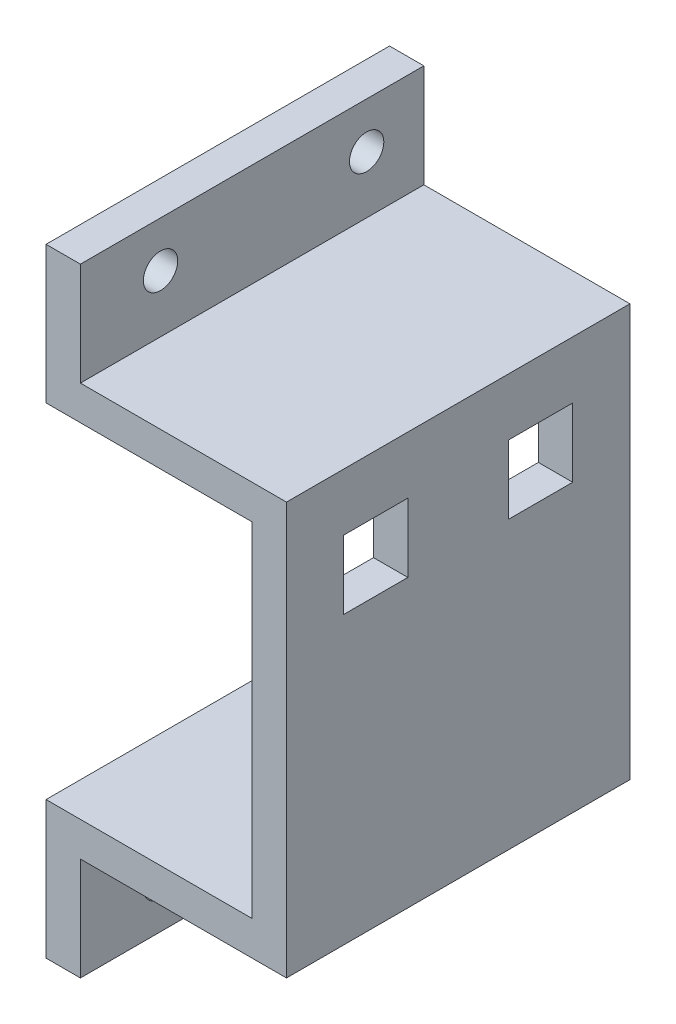
ISO-10303-21;
HEADER;
FILE_DESCRIPTION(('STEP AP214'),'2;1');
FILE_NAME('part.step','',(''),(''),'','','');
FILE_SCHEMA(('AUTOMOTIVE_DESIGN { 1 0 10303 214 1 1 1 1 }'));
ENDSEC;
DATA;
#1=APPLICATION_CONTEXT('core data for automotive mechanical design processes');
#2=APPLICATION_PROTOCOL_DEFINITION('international standard','automotive_design',2000,#1);
#3=PRODUCT_CONTEXT('',#1,'mechanical');
#4=PRODUCT('Part','Part','',(#3));
#5=PRODUCT_RELATED_PRODUCT_CATEGORY('part','',(#4));
#6=PRODUCT_DEFINITION_FORMATION('','',#4);
#7=PRODUCT_DEFINITION_CONTEXT('part definition',#1,'design');
#8=PRODUCT_DEFINITION('design','',#6,#7);
#9=PRODUCT_DEFINITION_SHAPE('','',#8);
#10=(LENGTH_UNIT() NAMED_UNIT(*) SI_UNIT(.MILLI.,.METRE.));
#11=(NAMED_UNIT(*) PLANE_ANGLE_UNIT() SI_UNIT($,.RADIAN.));
#12=(NAMED_UNIT(*) SI_UNIT($,.STERADIAN.) SOLID_ANGLE_UNIT());
#13=UNCERTAINTY_MEASURE_WITH_UNIT(LENGTH_MEASURE(1.E-05),#10,'distance_accuracy_value','');
#14=(GEOMETRIC_REPRESENTATION_CONTEXT(3) GLOBAL_UNCERTAINTY_ASSIGNED_CONTEXT((#13)) GLOBAL_UNIT_ASSIGNED_CONTEXT((#10,
#11,#12)) REPRESENTATION_CONTEXT('',''));
#15=CARTESIAN_POINT('',(0.,0.,0.));
#16=DIRECTION('',(0.,0.,1.));
#17=DIRECTION('',(1.,0.,0.));
#18=AXIS2_PLACEMENT_3D('',#15,#16,#17);
#19=CARTESIAN_POINT('',(18.,0.,15.));
#20=DIRECTION('',(1.,0.,0.));
#21=DIRECTION('',(0.,1.,0.));
#22=AXIS2_PLACEMENT_3D('',#19,#20,#21);
#23=PLANE('',#22);
#24=DIRECTION('',(0.,-1.,0.));
#25=VECTOR('',#24,1.);
#26=CARTESIAN_POINT('',(18.,0.,-15.));
#27=LINE('',#26,#25);
#28=CARTESIAN_POINT('',(18.,0.,-15.));
#29=VERTEX_POINT('',#28);
#30=CARTESIAN_POINT('',(18.,-30.,-15.));
#31=VERTEX_POINT('',#30);
#32=EDGE_CURVE('E268',#29,#31,#27,.T.);
#33=ORIENTED_EDGE('',*,*,#32,.T.);
#34=DIRECTION('',(0.,0.,-1.));
#35=VECTOR('',#34,1.);
#36=CARTESIAN_POINT('',(18.,-30.,15.));
#37=LINE('',#36,#35);
#38=CARTESIAN_POINT('',(18.,-30.,15.));
#39=VERTEX_POINT('',#38);
#40=EDGE_CURVE('E313',#39,#31,#37,.T.);
#41=ORIENTED_EDGE('',*,*,#40,.F.);
#42=DIRECTION('',(0.,-1.,0.));
#43=VECTOR('',#42,1.);
#44=CARTESIAN_POINT('',(18.,0.,15.));
#45=LINE('',#44,#43);
#46=CARTESIAN_POINT('',(18.,0.,15.));
#47=VERTEX_POINT('',#46);
#48=EDGE_CURVE('E243',#47,#39,#45,.T.);
#49=ORIENTED_EDGE('',*,*,#48,.F.);
#50=DIRECTION('',(0.,0.,-1.));
#51=VECTOR('',#50,1.);
#52=CARTESIAN_POINT('',(18.,0.,15.));
#53=LINE('',#52,#51);
#54=EDGE_CURVE('E41',#47,#29,#53,.T.);
#55=ORIENTED_EDGE('',*,*,#54,.T.);
#56=EDGE_LOOP('',(#33,#41,#49,#55));
#57=FACE_BOUND('',#56,.T.);
#58=DIRECTION('',(0.,0.,-1.));
#59=VECTOR('',#58,1.);
#60=CARTESIAN_POINT('',(18.,-8.,15.));
#61=LINE('',#60,#59);
#62=CARTESIAN_POINT('',(18.,-8.,10.));
#63=VERTEX_POINT('',#62);
#64=CARTESIAN_POINT('',(18.,-8.,4.4));
#65=VERTEX_POINT('',#64);
#66=EDGE_CURVE('E230',#63,#65,#61,.T.);
#67=ORIENTED_EDGE('',*,*,#66,.T.);
#68=DIRECTION('',(0.,1.,0.));
#69=VECTOR('',#68,1.);
#70=CARTESIAN_POINT('',(18.,0.,4.4));
#71=LINE('',#70,#69);
#72=CARTESIAN_POINT('',(18.,-2.,4.4));
#73=VERTEX_POINT('',#72);
#74=EDGE_CURVE('E233',#65,#73,#71,.T.);
#75=ORIENTED_EDGE('',*,*,#74,.T.);
#76=DIRECTION('',(0.,0.,1.));
#77=VECTOR('',#76,1.);
#78=CARTESIAN_POINT('',(18.,-2.,15.));
#79=LINE('',#78,#77);
#80=CARTESIAN_POINT('',(18.,-2.,10.));
#81=VERTEX_POINT('',#80);
#82=EDGE_CURVE('E218',#73,#81,#79,.T.);
#83=ORIENTED_EDGE('',*,*,#82,.T.);
#84=DIRECTION('',(0.,-1.,0.));
#85=VECTOR('',#84,1.);
#86=CARTESIAN_POINT('',(18.,0.,10.));
#87=LINE('',#86,#85);
#88=EDGE_CURVE('E227',#81,#63,#87,.T.);
#89=ORIENTED_EDGE('',*,*,#88,.T.);
#90=EDGE_LOOP('',(#67,#75,#83,#89));
#91=FACE_BOUND('',#90,.T.);
#92=DIRECTION('',(0.,1.,0.));
#93=VECTOR('',#92,1.);
#94=CARTESIAN_POINT('',(18.,0.,-4.4));
#95=LINE('',#94,#93);
#96=CARTESIAN_POINT('',(18.,-8.,-4.4));
#97=VERTEX_POINT('',#96);
#98=CARTESIAN_POINT('',(18.,-2.,-4.4));
#99=VERTEX_POINT('',#98);
#100=EDGE_CURVE('E202',#97,#99,#95,.T.);
#101=ORIENTED_EDGE('',*,*,#100,.F.);
#102=DIRECTION('',(0.,0.,1.));
#103=VECTOR('',#102,1.);
#104=CARTESIAN_POINT('',(18.,-8.,15.));
#105=LINE('',#104,#103);
#106=CARTESIAN_POINT('',(18.,-8.,-9.99999999999999));
#107=VERTEX_POINT('',#106);
#108=EDGE_CURVE('E195',#107,#97,#105,.T.);
#109=ORIENTED_EDGE('',*,*,#108,.F.);
#110=DIRECTION('',(0.,-1.,0.));
#111=VECTOR('',#110,1.);
#112=CARTESIAN_POINT('',(18.,0.,-10.));
#113=LINE('',#112,#111);
#114=CARTESIAN_POINT('',(18.,-2.,-10.));
#115=VERTEX_POINT('',#114);
#116=EDGE_CURVE('E176',#115,#107,#113,.T.);
#117=ORIENTED_EDGE('',*,*,#116,.F.);
#118=DIRECTION('',(0.,0.,-1.));
#119=VECTOR('',#118,1.);
#120=CARTESIAN_POINT('',(18.,-2.,15.));
#121=LINE('',#120,#119);
#122=EDGE_CURVE('E200',#99,#115,#121,.T.);
#123=ORIENTED_EDGE('',*,*,#122,.F.);
#124=EDGE_LOOP('',(#101,#109,#117,#123));
#125=FACE_BOUND('',#124,.T.);
#126=ADVANCED_FACE('F33',(#57,#91,#125),#23,.F.);
#127=CARTESIAN_POINT('',(21.,3.,15.));
#128=DIRECTION('',(-1.,0.,0.));
#129=DIRECTION('',(0.,-1.,0.));
#130=AXIS2_PLACEMENT_3D('',#127,#128,#129);
#131=PLANE('',#130);
#132=DIRECTION('',(0.,1.,0.));
#133=VECTOR('',#132,1.);
#134=CARTESIAN_POINT('',(21.,3.,-15.));
#135=LINE('',#134,#133);
#136=CARTESIAN_POINT('',(21.,-33.,-15.));
#137=VERTEX_POINT('',#136);
#138=CARTESIAN_POINT('',(21.,3.,-15.));
#139=VERTEX_POINT('',#138);
#140=EDGE_CURVE('E280',#137,#139,#135,.T.);
#141=ORIENTED_EDGE('',*,*,#140,.T.);
#142=DIRECTION('',(0.,0.,-1.));
#143=VECTOR('',#142,1.);
#144=CARTESIAN_POINT('',(21.,3.,15.));
#145=LINE('',#144,#143);
#146=CARTESIAN_POINT('',(21.,3.,15.));
#147=VERTEX_POINT('',#146);
#148=EDGE_CURVE('E295',#147,#139,#145,.T.);
#149=ORIENTED_EDGE('',*,*,#148,.F.);
#150=DIRECTION('',(0.,1.,0.));
#151=VECTOR('',#150,1.);
#152=CARTESIAN_POINT('',(21.,3.,15.));
#153=LINE('',#152,#151);
#154=CARTESIAN_POINT('',(21.,-33.,15.));
#155=VERTEX_POINT('',#154);
#156=EDGE_CURVE('E255',#155,#147,#153,.T.);
#157=ORIENTED_EDGE('',*,*,#156,.F.);
#158=DIRECTION('',(0.,0.,-1.));
#159=VECTOR('',#158,1.);
#160=CARTESIAN_POINT('',(21.,-33.,15.));
#161=LINE('',#160,#159);
#162=EDGE_CURVE('E298',#155,#137,#161,.T.);
#163=ORIENTED_EDGE('',*,*,#162,.T.);
#164=EDGE_LOOP('',(#141,#149,#157,#163));
#165=FACE_BOUND('',#164,.T.);
#166=DIRECTION('',(0.,0.,1.));
#167=VECTOR('',#166,1.);
#168=CARTESIAN_POINT('',(21.,-2.,10.));
#169=LINE('',#168,#167);
#170=CARTESIAN_POINT('',(21.,-2.,4.4));
#171=VERTEX_POINT('',#170);
#172=CARTESIAN_POINT('',(21.,-2.,10.));
#173=VERTEX_POINT('',#172);
#174=EDGE_CURVE('E206',#171,#173,#169,.T.);
#175=ORIENTED_EDGE('',*,*,#174,.F.);
#176=DIRECTION('',(0.,1.,0.));
#177=VECTOR('',#176,1.);
#178=CARTESIAN_POINT('',(21.,-8.,4.4));
#179=LINE('',#178,#177);
#180=CARTESIAN_POINT('',(21.,-8.,4.4));
#181=VERTEX_POINT('',#180);
#182=EDGE_CURVE('E204',#181,#171,#179,.T.);
#183=ORIENTED_EDGE('',*,*,#182,.F.);
#184=DIRECTION('',(0.,0.,-1.));
#185=VECTOR('',#184,1.);
#186=CARTESIAN_POINT('',(21.,-8.,10.));
#187=LINE('',#186,#185);
#188=CARTESIAN_POINT('',(21.,-8.,10.));
#189=VERTEX_POINT('',#188);
#190=EDGE_CURVE('E212',#189,#181,#187,.T.);
#191=ORIENTED_EDGE('',*,*,#190,.F.);
#192=DIRECTION('',(0.,-1.,0.));
#193=VECTOR('',#192,1.);
#194=CARTESIAN_POINT('',(21.,-8.,10.));
#195=LINE('',#194,#193);
#196=EDGE_CURVE('E209',#173,#189,#195,.T.);
#197=ORIENTED_EDGE('',*,*,#196,.F.);
#198=EDGE_LOOP('',(#175,#183,#191,#197));
#199=FACE_BOUND('',#198,.T.);
#200=DIRECTION('',(0.,1.,0.));
#201=VECTOR('',#200,1.);
#202=CARTESIAN_POINT('',(21.,-8.,-4.4));
#203=LINE('',#202,#201);
#204=CARTESIAN_POINT('',(21.,-8.,-4.4));
#205=VERTEX_POINT('',#204);
#206=CARTESIAN_POINT('',(21.,-2.,-4.4));
#207=VERTEX_POINT('',#206);
#208=EDGE_CURVE('E56',#205,#207,#203,.T.);
#209=ORIENTED_EDGE('',*,*,#208,.T.);
#210=DIRECTION('',(0.,0.,-1.));
#211=VECTOR('',#210,1.);
#212=CARTESIAN_POINT('',(21.,-2.,-10.));
#213=LINE('',#212,#211);
#214=CARTESIAN_POINT('',(21.,-2.,-10.));
#215=VERTEX_POINT('',#214);
#216=EDGE_CURVE('E188',#207,#215,#213,.T.);
#217=ORIENTED_EDGE('',*,*,#216,.T.);
#218=DIRECTION('',(0.,-1.,0.));
#219=VECTOR('',#218,1.);
#220=CARTESIAN_POINT('',(21.,-8.,-10.));
#221=LINE('',#220,#219);
#222=CARTESIAN_POINT('',(21.,-8.,-10.));
#223=VERTEX_POINT('',#222);
#224=EDGE_CURVE('E173',#215,#223,#221,.T.);
#225=ORIENTED_EDGE('',*,*,#224,.T.);
#226=DIRECTION('',(0.,0.,1.));
#227=VECTOR('',#226,1.);
#228=CARTESIAN_POINT('',(21.,-8.,-10.));
#229=LINE('',#228,#227);
#230=EDGE_CURVE('E182',#223,#205,#229,.T.);
#231=ORIENTED_EDGE('',*,*,#230,.T.);
#232=EDGE_LOOP('',(#209,#217,#225,#231));
#233=FACE_BOUND('',#232,.T.);
#234=ADVANCED_FACE('F186',(#165,#199,#233),#131,.F.);
#235=CARTESIAN_POINT('',(0.,0.,15.));
#236=DIRECTION('',(1.,0.,0.));
#237=DIRECTION('',(0.,1.,0.));
#238=AXIS2_PLACEMENT_3D('',#235,#236,#237);
#239=PLANE('',#238);
#240=CARTESIAN_POINT('',(0.,8.,-10.));
#241=DIRECTION('',(1.,0.,0.));
#242=DIRECTION('',(0.,1.,0.));
#243=AXIS2_PLACEMENT_3D('',#240,#241,#242);
#244=CIRCLE('',#243,1.5);
#245=CARTESIAN_POINT('',(0.,9.5,-10.));
#246=VERTEX_POINT('',#245);
#247=EDGE_CURVE('E409',#246,#246,#244,.T.);
#248=ORIENTED_EDGE('',*,*,#247,.T.);
#249=EDGE_LOOP('',(#248));
#250=FACE_BOUND('',#249,.T.);
#251=CARTESIAN_POINT('',(0.,8.,8.));
#252=DIRECTION('',(1.,0.,0.));
#253=DIRECTION('',(0.,1.,0.));
#254=AXIS2_PLACEMENT_3D('',#251,#252,#253);
#255=CIRCLE('',#254,1.5);
#256=CARTESIAN_POINT('',(0.,9.5,8.));
#257=VERTEX_POINT('',#256);
#258=EDGE_CURVE('E412',#257,#257,#255,.T.);
#259=ORIENTED_EDGE('',*,*,#258,.T.);
#260=EDGE_LOOP('',(#259));
#261=FACE_BOUND('',#260,.T.);
#262=DIRECTION('',(0.,-1.,0.));
#263=VECTOR('',#262,1.);
#264=CARTESIAN_POINT('',(0.,0.,-15.));
#265=LINE('',#264,#263);
#266=CARTESIAN_POINT('',(0.,12.,-15.));
#267=VERTEX_POINT('',#266);
#268=CARTESIAN_POINT('',(0.,0.,-15.));
#269=VERTEX_POINT('',#268);
#270=EDGE_CURVE('E236',#267,#269,#265,.T.);
#271=ORIENTED_EDGE('',*,*,#270,.T.);
#272=DIRECTION('',(0.,0.,-1.));
#273=VECTOR('',#272,1.);
#274=CARTESIAN_POINT('',(0.,0.,15.));
#275=LINE('',#274,#273);
#276=CARTESIAN_POINT('',(0.,0.,15.));
#277=VERTEX_POINT('',#276);
#278=EDGE_CURVE('E11',#277,#269,#275,.T.);
#279=ORIENTED_EDGE('',*,*,#278,.F.);
#280=DIRECTION('',(0.,-1.,0.));
#281=VECTOR('',#280,1.);
#282=CARTESIAN_POINT('',(0.,0.,15.));
#283=LINE('',#282,#281);
#284=CARTESIAN_POINT('',(0.,12.,15.));
#285=VERTEX_POINT('',#284);
#286=EDGE_CURVE('E237',#285,#277,#283,.T.);
#287=ORIENTED_EDGE('',*,*,#286,.F.);
#288=DIRECTION('',(0.,0.,-1.));
#289=VECTOR('',#288,1.);
#290=CARTESIAN_POINT('',(0.,12.,15.));
#291=LINE('',#290,#289);
#292=EDGE_CURVE('E263',#285,#267,#291,.T.);
#293=ORIENTED_EDGE('',*,*,#292,.T.);
#294=EDGE_LOOP('',(#271,#279,#287,#293));
#295=FACE_BOUND('',#294,.T.);
#296=ADVANCED_FACE('F35',(#250,#261,#295),#239,.F.);
#297=CARTESIAN_POINT('',(0.,0.,15.));
#298=DIRECTION('',(0.,1.,0.));
#299=DIRECTION('',(0.,0.,1.));
#300=AXIS2_PLACEMENT_3D('',#297,#298,#299);
#301=PLANE('',#300);
#302=DIRECTION('',(1.,0.,0.));
#303=VECTOR('',#302,1.);
#304=CARTESIAN_POINT('',(0.,0.,-15.));
#305=LINE('',#304,#303);
#306=EDGE_CURVE('E266',#269,#29,#305,.T.);
#307=ORIENTED_EDGE('',*,*,#306,.T.);
#308=ORIENTED_EDGE('',*,*,#54,.F.);
#309=DIRECTION('',(1.,0.,0.));
#310=VECTOR('',#309,1.);
#311=CARTESIAN_POINT('',(0.,0.,15.));
#312=LINE('',#311,#310);
#313=EDGE_CURVE('E240',#277,#47,#312,.T.);
#314=ORIENTED_EDGE('',*,*,#313,.F.);
#315=ORIENTED_EDGE('',*,*,#278,.T.);
#316=EDGE_LOOP('',(#307,#308,#314,#315));
#317=FACE_BOUND('',#316,.T.);
#318=ADVANCED_FACE('F343',(#317),#301,.F.);
#319=CARTESIAN_POINT('',(18.,-30.,15.));
#320=DIRECTION('',(0.,-1.,0.));
#321=DIRECTION('',(1.,0.,0.));
#322=AXIS2_PLACEMENT_3D('',#319,#320,#321);
#323=PLANE('',#322);
#324=DIRECTION('',(-1.,0.,0.));
#325=VECTOR('',#324,1.);
#326=CARTESIAN_POINT('',(18.,-30.,-15.));
#327=LINE('',#326,#325);
#328=CARTESIAN_POINT('',(0.,-30.,-15.));
#329=VERTEX_POINT('',#328);
#330=EDGE_CURVE('E270',#31,#329,#327,.T.);
#331=ORIENTED_EDGE('',*,*,#330,.T.);
#332=DIRECTION('',(0.,0.,-1.));
#333=VECTOR('',#332,1.);
#334=CARTESIAN_POINT('',(0.,-30.,15.));
#335=LINE('',#334,#333);
#336=CARTESIAN_POINT('',(0.,-30.,15.));
#337=VERTEX_POINT('',#336);
#338=EDGE_CURVE('E310',#337,#329,#335,.T.);
#339=ORIENTED_EDGE('',*,*,#338,.F.);
#340=DIRECTION('',(-1.,0.,0.));
#341=VECTOR('',#340,1.);
#342=CARTESIAN_POINT('',(18.,-30.,15.));
#343=LINE('',#342,#341);
#344=EDGE_CURVE('E245',#39,#337,#343,.T.);
#345=ORIENTED_EDGE('',*,*,#344,.F.);
#346=ORIENTED_EDGE('',*,*,#40,.T.);
#347=EDGE_LOOP('',(#331,#339,#345,#346));
#348=FACE_BOUND('',#347,.T.);
#349=ADVANCED_FACE('F331',(#348),#323,.F.);
#350=CARTESIAN_POINT('',(0.,-30.,15.));
#351=DIRECTION('',(1.,0.,0.));
#352=DIRECTION('',(0.,1.,0.));
#353=AXIS2_PLACEMENT_3D('',#350,#351,#352);
#354=PLANE('',#353);
#355=CARTESIAN_POINT('',(0.,-38.,-10.));
#356=DIRECTION('',(1.,0.,0.));
#357=DIRECTION('',(0.,1.,0.));
#358=AXIS2_PLACEMENT_3D('',#355,#356,#357);
#359=CIRCLE('',#358,1.5);
#360=CARTESIAN_POINT('',(0.,-36.5,-10.));
#361=VERTEX_POINT('',#360);
#362=EDGE_CURVE('E429',#361,#361,#359,.F.);
#363=ORIENTED_EDGE('',*,*,#362,.F.);
#364=EDGE_LOOP('',(#363));
#365=FACE_BOUND('',#364,.T.);
#366=CARTESIAN_POINT('',(0.,-38.,8.));
#367=DIRECTION('',(1.,0.,0.));
#368=DIRECTION('',(0.,1.,0.));
#369=AXIS2_PLACEMENT_3D('',#366,#367,#368);
#370=CIRCLE('',#369,1.5);
#371=CARTESIAN_POINT('',(0.,-36.5,8.));
#372=VERTEX_POINT('',#371);
#373=EDGE_CURVE('E423',#372,#372,#370,.F.);
#374=ORIENTED_EDGE('',*,*,#373,.F.);
#375=EDGE_LOOP('',(#374));
#376=FACE_BOUND('',#375,.T.);
#377=DIRECTION('',(0.,-1.,0.));
#378=VECTOR('',#377,1.);
#379=CARTESIAN_POINT('',(0.,-30.,-15.));
#380=LINE('',#379,#378);
#381=CARTESIAN_POINT('',(0.,-42.,-15.));
#382=VERTEX_POINT('',#381);
#383=EDGE_CURVE('E272',#329,#382,#380,.T.);
#384=ORIENTED_EDGE('',*,*,#383,.T.);
#385=DIRECTION('',(0.,0.,-1.));
#386=VECTOR('',#385,1.);
#387=CARTESIAN_POINT('',(0.,-42.,15.));
#388=LINE('',#387,#386);
#389=CARTESIAN_POINT('',(0.,-42.,15.));
#390=VERTEX_POINT('',#389);
#391=EDGE_CURVE('E307',#390,#382,#388,.T.);
#392=ORIENTED_EDGE('',*,*,#391,.F.);
#393=DIRECTION('',(0.,-1.,0.));
#394=VECTOR('',#393,1.);
#395=CARTESIAN_POINT('',(0.,-30.,15.));
#396=LINE('',#395,#394);
#397=EDGE_CURVE('E247',#337,#390,#396,.T.);
#398=ORIENTED_EDGE('',*,*,#397,.F.);
#399=ORIENTED_EDGE('',*,*,#338,.T.);
#400=EDGE_LOOP('',(#384,#392,#398,#399));
#401=FACE_BOUND('',#400,.T.);
#402=ADVANCED_FACE('F335',(#365,#376,#401),#354,.F.);
#403=CARTESIAN_POINT('',(3.,-42.,15.));
#404=DIRECTION('',(0.,1.,0.));
#405=DIRECTION('',(0.,0.,1.));
#406=AXIS2_PLACEMENT_3D('',#403,#404,#405);
#407=PLANE('',#406);
#408=DIRECTION('',(1.,0.,0.));
#409=VECTOR('',#408,1.);
#410=CARTESIAN_POINT('',(3.,-42.,-15.));
#411=LINE('',#410,#409);
#412=CARTESIAN_POINT('',(3.,-42.,-15.));
#413=VERTEX_POINT('',#412);
#414=EDGE_CURVE('E274',#382,#413,#411,.T.);
#415=ORIENTED_EDGE('',*,*,#414,.T.);
#416=DIRECTION('',(0.,0.,-1.));
#417=VECTOR('',#416,1.);
#418=CARTESIAN_POINT('',(3.,-42.,15.));
#419=LINE('',#418,#417);
#420=CARTESIAN_POINT('',(3.,-42.,15.));
#421=VERTEX_POINT('',#420);
#422=EDGE_CURVE('E304',#421,#413,#419,.T.);
#423=ORIENTED_EDGE('',*,*,#422,.F.);
#424=DIRECTION('',(1.,0.,0.));
#425=VECTOR('',#424,1.);
#426=CARTESIAN_POINT('',(3.,-42.,15.));
#427=LINE('',#426,#425);
#428=EDGE_CURVE('E249',#390,#421,#427,.T.);
#429=ORIENTED_EDGE('',*,*,#428,.F.);
#430=ORIENTED_EDGE('',*,*,#391,.T.);
#431=EDGE_LOOP('',(#415,#423,#429,#430));
#432=FACE_BOUND('',#431,.T.);
#433=ADVANCED_FACE('F376',(#432),#407,.F.);
#434=CARTESIAN_POINT('',(3.,-33.,15.));
#435=DIRECTION('',(-1.,0.,0.));
#436=DIRECTION('',(0.,-1.,0.));
#437=AXIS2_PLACEMENT_3D('',#434,#435,#436);
#438=PLANE('',#437);
#439=CARTESIAN_POINT('',(2.99999999999998,-38.,-10.));
#440=DIRECTION('',(-1.,0.,0.));
#441=DIRECTION('',(0.,-1.,0.));
#442=AXIS2_PLACEMENT_3D('',#439,#440,#441);
#443=CIRCLE('',#442,1.5);
#444=CARTESIAN_POINT('',(2.99999999999998,-39.5,-10.));
#445=VERTEX_POINT('',#444);
#446=EDGE_CURVE('E432',#445,#445,#443,.T.);
#447=ORIENTED_EDGE('',*,*,#446,.T.);
#448=EDGE_LOOP('',(#447));
#449=FACE_BOUND('',#448,.T.);
#450=CARTESIAN_POINT('',(2.99999999999998,-38.,8.));
#451=DIRECTION('',(-1.,0.,0.));
#452=DIRECTION('',(0.,-1.,0.));
#453=AXIS2_PLACEMENT_3D('',#450,#451,#452);
#454=CIRCLE('',#453,1.5);
#455=CARTESIAN_POINT('',(2.99999999999998,-39.5,8.));
#456=VERTEX_POINT('',#455);
#457=EDGE_CURVE('E426',#456,#456,#454,.T.);
#458=ORIENTED_EDGE('',*,*,#457,.T.);
#459=EDGE_LOOP('',(#458));
#460=FACE_BOUND('',#459,.T.);
#461=DIRECTION('',(0.,1.,0.));
#462=VECTOR('',#461,1.);
#463=CARTESIAN_POINT('',(3.,-33.,-15.));
#464=LINE('',#463,#462);
#465=CARTESIAN_POINT('',(3.,-33.,-15.));
#466=VERTEX_POINT('',#465);
#467=EDGE_CURVE('E276',#413,#466,#464,.T.);
#468=ORIENTED_EDGE('',*,*,#467,.T.);
#469=DIRECTION('',(0.,0.,-1.));
#470=VECTOR('',#469,1.);
#471=CARTESIAN_POINT('',(3.,-33.,15.));
#472=LINE('',#471,#470);
#473=CARTESIAN_POINT('',(3.,-33.,15.));
#474=VERTEX_POINT('',#473);
#475=EDGE_CURVE('E301',#474,#466,#472,.T.);
#476=ORIENTED_EDGE('',*,*,#475,.F.);
#477=DIRECTION('',(0.,1.,0.));
#478=VECTOR('',#477,1.);
#479=CARTESIAN_POINT('',(3.,-33.,15.));
#480=LINE('',#479,#478);
#481=EDGE_CURVE('E251',#421,#474,#480,.T.);
#482=ORIENTED_EDGE('',*,*,#481,.F.);
#483=ORIENTED_EDGE('',*,*,#422,.T.);
#484=EDGE_LOOP('',(#468,#476,#482,#483));
#485=FACE_BOUND('',#484,.T.);
#486=ADVANCED_FACE('F374',(#449,#460,#485),#438,.F.);
#487=CARTESIAN_POINT('',(21.,-33.,15.));
#488=DIRECTION('',(0.,1.,0.));
#489=DIRECTION('',(-1.,0.,0.));
#490=AXIS2_PLACEMENT_3D('',#487,#488,#489);
#491=PLANE('',#490);
#492=DIRECTION('',(1.,0.,0.));
#493=VECTOR('',#492,1.);
#494=CARTESIAN_POINT('',(21.,-33.,-15.));
#495=LINE('',#494,#493);
#496=EDGE_CURVE('E278',#466,#137,#495,.T.);
#497=ORIENTED_EDGE('',*,*,#496,.T.);
#498=ORIENTED_EDGE('',*,*,#162,.F.);
#499=DIRECTION('',(1.,0.,0.));
#500=VECTOR('',#499,1.);
#501=CARTESIAN_POINT('',(21.,-33.,15.));
#502=LINE('',#501,#500);
#503=EDGE_CURVE('E253',#474,#155,#502,.T.);
#504=ORIENTED_EDGE('',*,*,#503,.F.);
#505=ORIENTED_EDGE('',*,*,#475,.T.);
#506=EDGE_LOOP('',(#497,#498,#504,#505));
#507=FACE_BOUND('',#506,.T.);
#508=ADVANCED_FACE('F370',(#507),#491,.F.);
#509=CARTESIAN_POINT('',(3.,3.,15.));
#510=DIRECTION('',(0.,-1.,0.));
#511=DIRECTION('',(0.,0.,-1.));
#512=AXIS2_PLACEMENT_3D('',#509,#510,#511);
#513=PLANE('',#512);
#514=DIRECTION('',(-1.,0.,0.));
#515=VECTOR('',#514,1.);
#516=CARTESIAN_POINT('',(3.,3.,-15.));
#517=LINE('',#516,#515);
#518=CARTESIAN_POINT('',(3.,3.,-15.));
#519=VERTEX_POINT('',#518);
#520=EDGE_CURVE('E282',#139,#519,#517,.T.);
#521=ORIENTED_EDGE('',*,*,#520,.T.);
#522=DIRECTION('',(0.,0.,-1.));
#523=VECTOR('',#522,1.);
#524=CARTESIAN_POINT('',(3.,3.,15.));
#525=LINE('',#524,#523);
#526=CARTESIAN_POINT('',(3.,3.,15.));
#527=VERTEX_POINT('',#526);
#528=EDGE_CURVE('E292',#527,#519,#525,.T.);
#529=ORIENTED_EDGE('',*,*,#528,.F.);
#530=DIRECTION('',(-1.,0.,0.));
#531=VECTOR('',#530,1.);
#532=CARTESIAN_POINT('',(3.,3.,15.));
#533=LINE('',#532,#531);
#534=EDGE_CURVE('E257',#147,#527,#533,.T.);
#535=ORIENTED_EDGE('',*,*,#534,.F.);
#536=ORIENTED_EDGE('',*,*,#148,.T.);
#537=EDGE_LOOP('',(#521,#529,#535,#536));
#538=FACE_BOUND('',#537,.T.);
#539=ADVANCED_FACE('F359',(#538),#513,.F.);
#540=CARTESIAN_POINT('',(3.,3.,15.));
#541=DIRECTION('',(-1.,0.,0.));
#542=DIRECTION('',(0.,-1.,0.));
#543=AXIS2_PLACEMENT_3D('',#540,#541,#542);
#544=PLANE('',#543);
#545=CARTESIAN_POINT('',(3.,8.,-10.));
#546=DIRECTION('',(1.,0.,0.));
#547=DIRECTION('',(0.,1.,0.));
#548=AXIS2_PLACEMENT_3D('',#545,#546,#547);
#549=CIRCLE('',#548,1.5);
#550=CARTESIAN_POINT('',(3.,9.5,-10.));
#551=VERTEX_POINT('',#550);
#552=EDGE_CURVE('E420',#551,#551,#549,.T.);
#553=ORIENTED_EDGE('',*,*,#552,.F.);
#554=EDGE_LOOP('',(#553));
#555=FACE_BOUND('',#554,.T.);
#556=CARTESIAN_POINT('',(3.,8.,8.));
#557=DIRECTION('',(1.,0.,0.));
#558=DIRECTION('',(0.,1.,0.));
#559=AXIS2_PLACEMENT_3D('',#556,#557,#558);
#560=CIRCLE('',#559,1.5);
#561=CARTESIAN_POINT('',(3.,9.5,8.));
#562=VERTEX_POINT('',#561);
#563=EDGE_CURVE('E414',#562,#562,#560,.T.);
#564=ORIENTED_EDGE('',*,*,#563,.F.);
#565=EDGE_LOOP('',(#564));
#566=FACE_BOUND('',#565,.T.);
#567=DIRECTION('',(0.,1.,0.));
#568=VECTOR('',#567,1.);
#569=CARTESIAN_POINT('',(3.,3.,-15.));
#570=LINE('',#569,#568);
#571=CARTESIAN_POINT('',(3.,12.,-15.));
#572=VERTEX_POINT('',#571);
#573=EDGE_CURVE('E284',#519,#572,#570,.T.);
#574=ORIENTED_EDGE('',*,*,#573,.T.);
#575=DIRECTION('',(0.,0.,-1.));
#576=VECTOR('',#575,1.);
#577=CARTESIAN_POINT('',(3.,12.,15.));
#578=LINE('',#577,#576);
#579=CARTESIAN_POINT('',(3.,12.,15.));
#580=VERTEX_POINT('',#579);
#581=EDGE_CURVE('E289',#580,#572,#578,.T.);
#582=ORIENTED_EDGE('',*,*,#581,.F.);
#583=DIRECTION('',(0.,1.,0.));
#584=VECTOR('',#583,1.);
#585=CARTESIAN_POINT('',(3.,3.,15.));
#586=LINE('',#585,#584);
#587=EDGE_CURVE('E259',#527,#580,#586,.T.);
#588=ORIENTED_EDGE('',*,*,#587,.F.);
#589=ORIENTED_EDGE('',*,*,#528,.T.);
#590=EDGE_LOOP('',(#574,#582,#588,#589));
#591=FACE_BOUND('',#590,.T.);
#592=ADVANCED_FACE('F355',(#555,#566,#591),#544,.F.);
#593=CARTESIAN_POINT('',(0.,12.,15.));
#594=DIRECTION('',(0.,-1.,0.));
#595=DIRECTION('',(0.,0.,-1.));
#596=AXIS2_PLACEMENT_3D('',#593,#594,#595);
#597=PLANE('',#596);
#598=DIRECTION('',(-1.,0.,0.));
#599=VECTOR('',#598,1.);
#600=CARTESIAN_POINT('',(0.,12.,-15.));
#601=LINE('',#600,#599);
#602=EDGE_CURVE('E241',#572,#267,#601,.T.);
#603=ORIENTED_EDGE('',*,*,#602,.T.);
#604=ORIENTED_EDGE('',*,*,#292,.F.);
#605=DIRECTION('',(-1.,0.,0.));
#606=VECTOR('',#605,1.);
#607=CARTESIAN_POINT('',(0.,12.,15.));
#608=LINE('',#607,#606);
#609=EDGE_CURVE('E261',#580,#285,#608,.T.);
#610=ORIENTED_EDGE('',*,*,#609,.F.);
#611=ORIENTED_EDGE('',*,*,#581,.T.);
#612=EDGE_LOOP('',(#603,#604,#610,#611));
#613=FACE_BOUND('',#612,.T.);
#614=ADVANCED_FACE('F350',(#613),#597,.F.);
#615=CARTESIAN_POINT('',(0.,0.,15.));
#616=DIRECTION('',(0.,0.,-1.));
#617=DIRECTION('',(-1.,0.,0.));
#618=AXIS2_PLACEMENT_3D('',#615,#616,#617);
#619=PLANE('',#618);
#620=ORIENTED_EDGE('',*,*,#286,.T.);
#621=ORIENTED_EDGE('',*,*,#313,.T.);
#622=ORIENTED_EDGE('',*,*,#48,.T.);
#623=ORIENTED_EDGE('',*,*,#344,.T.);
#624=ORIENTED_EDGE('',*,*,#397,.T.);
#625=ORIENTED_EDGE('',*,*,#428,.T.);
#626=ORIENTED_EDGE('',*,*,#481,.T.);
#627=ORIENTED_EDGE('',*,*,#503,.T.);
#628=ORIENTED_EDGE('',*,*,#156,.T.);
#629=ORIENTED_EDGE('',*,*,#534,.T.);
#630=ORIENTED_EDGE('',*,*,#587,.T.);
#631=ORIENTED_EDGE('',*,*,#609,.T.);
#632=EDGE_LOOP('',(#620,#621,#622,#623,#624,#625,#626,#627,#628,#629,#630,#631));
#633=FACE_BOUND('',#632,.T.);
#634=ADVANCED_FACE('F339',(#633),#619,.F.);
#635=CARTESIAN_POINT('',(0.,0.,-15.));
#636=DIRECTION('',(0.,0.,-1.));
#637=DIRECTION('',(-1.,0.,0.));
#638=AXIS2_PLACEMENT_3D('',#635,#636,#637);
#639=PLANE('',#638);
#640=ORIENTED_EDGE('',*,*,#270,.F.);
#641=ORIENTED_EDGE('',*,*,#602,.F.);
#642=ORIENTED_EDGE('',*,*,#573,.F.);
#643=ORIENTED_EDGE('',*,*,#520,.F.);
#644=ORIENTED_EDGE('',*,*,#140,.F.);
#645=ORIENTED_EDGE('',*,*,#496,.F.);
#646=ORIENTED_EDGE('',*,*,#467,.F.);
#647=ORIENTED_EDGE('',*,*,#414,.F.);
#648=ORIENTED_EDGE('',*,*,#383,.F.);
#649=ORIENTED_EDGE('',*,*,#330,.F.);
#650=ORIENTED_EDGE('',*,*,#32,.F.);
#651=ORIENTED_EDGE('',*,*,#306,.F.);
#652=EDGE_LOOP('',(#640,#641,#642,#643,#644,#645,#646,#647,#648,#649,#650,#651));
#653=FACE_BOUND('',#652,.T.);
#654=ADVANCED_FACE('F326',(#653),#639,.T.);
#655=CARTESIAN_POINT('',(1.,-8.00000000000001,4.4));
#656=DIRECTION('',(0.,0.,-1.));
#657=DIRECTION('',(-1.,0.,0.));
#658=AXIS2_PLACEMENT_3D('',#655,#656,#657);
#659=PLANE('',#658);
#660=DIRECTION('',(1.,0.,0.));
#661=VECTOR('',#660,1.);
#662=CARTESIAN_POINT('',(1.,-8.00000000000001,4.4));
#663=LINE('',#662,#661);
#664=EDGE_CURVE('E216',#65,#181,#663,.T.);
#665=ORIENTED_EDGE('',*,*,#664,.T.);
#666=ORIENTED_EDGE('',*,*,#182,.T.);
#667=DIRECTION('',(1.,0.,0.));
#668=VECTOR('',#667,1.);
#669=CARTESIAN_POINT('',(0.999999999999997,-2.00000000000001,4.4));
#670=LINE('',#669,#668);
#671=EDGE_CURVE('E215',#73,#171,#670,.T.);
#672=ORIENTED_EDGE('',*,*,#671,.F.);
#673=ORIENTED_EDGE('',*,*,#74,.F.);
#674=EDGE_LOOP('',(#665,#666,#672,#673));
#675=FACE_BOUND('',#674,.T.);
#676=ADVANCED_FACE('F477',(#675),#659,.F.);
#677=CARTESIAN_POINT('',(1.,-8.00000000000001,10.));
#678=DIRECTION('',(0.,-1.,0.));
#679=DIRECTION('',(1.,0.,0.));
#680=AXIS2_PLACEMENT_3D('',#677,#678,#679);
#681=PLANE('',#680);
#682=DIRECTION('',(1.,0.,0.));
#683=VECTOR('',#682,1.);
#684=CARTESIAN_POINT('',(1.,-8.00000000000001,10.));
#685=LINE('',#684,#683);
#686=EDGE_CURVE('E219',#63,#189,#685,.T.);
#687=ORIENTED_EDGE('',*,*,#686,.T.);
#688=ORIENTED_EDGE('',*,*,#190,.T.);
#689=ORIENTED_EDGE('',*,*,#664,.F.);
#690=ORIENTED_EDGE('',*,*,#66,.F.);
#691=EDGE_LOOP('',(#687,#688,#689,#690));
#692=FACE_BOUND('',#691,.T.);
#693=ADVANCED_FACE('F473',(#692),#681,.F.);
#694=CARTESIAN_POINT('',(1.,-8.00000000000001,10.));
#695=DIRECTION('',(0.,0.,1.));
#696=DIRECTION('',(1.,0.,0.));
#697=AXIS2_PLACEMENT_3D('',#694,#695,#696);
#698=PLANE('',#697);
#699=DIRECTION('',(1.,0.,0.));
#700=VECTOR('',#699,1.);
#701=CARTESIAN_POINT('',(0.999999999999997,-2.00000000000001,10.));
#702=LINE('',#701,#700);
#703=EDGE_CURVE('E221',#81,#173,#702,.T.);
#704=ORIENTED_EDGE('',*,*,#703,.T.);
#705=ORIENTED_EDGE('',*,*,#196,.T.);
#706=ORIENTED_EDGE('',*,*,#686,.F.);
#707=ORIENTED_EDGE('',*,*,#88,.F.);
#708=EDGE_LOOP('',(#704,#705,#706,#707));
#709=FACE_BOUND('',#708,.T.);
#710=ADVANCED_FACE('F476',(#709),#698,.F.);
#711=CARTESIAN_POINT('',(0.999999999999997,-2.00000000000001,10.));
#712=DIRECTION('',(0.,1.,0.));
#713=DIRECTION('',(-1.,0.,0.));
#714=AXIS2_PLACEMENT_3D('',#711,#712,#713);
#715=PLANE('',#714);
#716=ORIENTED_EDGE('',*,*,#671,.T.);
#717=ORIENTED_EDGE('',*,*,#174,.T.);
#718=ORIENTED_EDGE('',*,*,#703,.F.);
#719=ORIENTED_EDGE('',*,*,#82,.F.);
#720=EDGE_LOOP('',(#716,#717,#718,#719));
#721=FACE_BOUND('',#720,.T.);
#722=ADVANCED_FACE('F472',(#721),#715,.F.);
#723=CARTESIAN_POINT('',(1.,-8.00000000000001,-4.4));
#724=DIRECTION('',(0.,0.,-1.));
#725=DIRECTION('',(-1.,0.,0.));
#726=AXIS2_PLACEMENT_3D('',#723,#724,#725);
#727=PLANE('',#726);
#728=ORIENTED_EDGE('',*,*,#100,.T.);
#729=DIRECTION('',(1.,0.,0.));
#730=VECTOR('',#729,1.);
#731=CARTESIAN_POINT('',(0.999999999999997,-2.00000000000001,-4.4));
#732=LINE('',#731,#730);
#733=EDGE_CURVE('E193',#99,#207,#732,.T.);
#734=ORIENTED_EDGE('',*,*,#733,.T.);
#735=ORIENTED_EDGE('',*,*,#208,.F.);
#736=DIRECTION('',(1.,0.,0.));
#737=VECTOR('',#736,1.);
#738=CARTESIAN_POINT('',(1.,-8.00000000000001,-4.4));
#739=LINE('',#738,#737);
#740=EDGE_CURVE('E179',#97,#205,#739,.T.);
#741=ORIENTED_EDGE('',*,*,#740,.F.);
#742=EDGE_LOOP('',(#728,#734,#735,#741));
#743=FACE_BOUND('',#742,.T.);
#744=ADVANCED_FACE('F464',(#743),#727,.T.);
#745=CARTESIAN_POINT('',(0.999999999999997,-2.00000000000001,-10.));
#746=DIRECTION('',(0.,-1.,0.));
#747=DIRECTION('',(1.,0.,0.));
#748=AXIS2_PLACEMENT_3D('',#745,#746,#747);
#749=PLANE('',#748);
#750=ORIENTED_EDGE('',*,*,#122,.T.);
#751=DIRECTION('',(1.,0.,0.));
#752=VECTOR('',#751,1.);
#753=CARTESIAN_POINT('',(0.999999999999997,-2.00000000000001,-10.));
#754=LINE('',#753,#752);
#755=EDGE_CURVE('E178',#115,#215,#754,.T.);
#756=ORIENTED_EDGE('',*,*,#755,.T.);
#757=ORIENTED_EDGE('',*,*,#216,.F.);
#758=ORIENTED_EDGE('',*,*,#733,.F.);
#759=EDGE_LOOP('',(#750,#756,#757,#758));
#760=FACE_BOUND('',#759,.T.);
#761=ADVANCED_FACE('F461',(#760),#749,.T.);
#762=CARTESIAN_POINT('',(1.,-8.00000000000001,-10.));
#763=DIRECTION('',(0.,0.,1.));
#764=DIRECTION('',(1.,0.,0.));
#765=AXIS2_PLACEMENT_3D('',#762,#763,#764);
#766=PLANE('',#765);
#767=ORIENTED_EDGE('',*,*,#116,.T.);
#768=DIRECTION('',(1.,0.,0.));
#769=VECTOR('',#768,1.);
#770=CARTESIAN_POINT('',(1.,-8.00000000000001,-10.));
#771=LINE('',#770,#769);
#772=EDGE_CURVE('E48',#107,#223,#771,.T.);
#773=ORIENTED_EDGE('',*,*,#772,.T.);
#774=ORIENTED_EDGE('',*,*,#224,.F.);
#775=ORIENTED_EDGE('',*,*,#755,.F.);
#776=EDGE_LOOP('',(#767,#773,#774,#775));
#777=FACE_BOUND('',#776,.T.);
#778=ADVANCED_FACE('F170',(#777),#766,.T.);
#779=CARTESIAN_POINT('',(1.,-8.00000000000001,-10.));
#780=DIRECTION('',(0.,1.,0.));
#781=DIRECTION('',(-1.,0.,0.));
#782=AXIS2_PLACEMENT_3D('',#779,#780,#781);
#783=PLANE('',#782);
#784=ORIENTED_EDGE('',*,*,#108,.T.);
#785=ORIENTED_EDGE('',*,*,#740,.T.);
#786=ORIENTED_EDGE('',*,*,#230,.F.);
#787=ORIENTED_EDGE('',*,*,#772,.F.);
#788=EDGE_LOOP('',(#784,#785,#786,#787));
#789=FACE_BOUND('',#788,.T.);
#790=ADVANCED_FACE('F183',(#789),#783,.T.);
#791=CARTESIAN_POINT('',(-7.,8.,8.));
#792=DIRECTION('',(1.,0.,0.));
#793=DIRECTION('',(0.,1.,0.));
#794=AXIS2_PLACEMENT_3D('',#791,#792,#793);
#795=CYLINDRICAL_SURFACE('',#794,1.5);
#796=ORIENTED_EDGE('',*,*,#563,.T.);
#797=EDGE_LOOP('',(#796));
#798=FACE_BOUND('',#797,.T.);
#799=ORIENTED_EDGE('',*,*,#258,.F.);
#800=EDGE_LOOP('',(#799));
#801=FACE_BOUND('',#800,.T.);
#802=ADVANCED_FACE('F453',(#798,#801),#795,.F.);
#803=CARTESIAN_POINT('',(-7.,8.,-10.));
#804=DIRECTION('',(1.,0.,0.));
#805=DIRECTION('',(0.,1.,0.));
#806=AXIS2_PLACEMENT_3D('',#803,#804,#805);
#807=CYLINDRICAL_SURFACE('',#806,1.5);
#808=ORIENTED_EDGE('',*,*,#552,.T.);
#809=EDGE_LOOP('',(#808));
#810=FACE_BOUND('',#809,.T.);
#811=ORIENTED_EDGE('',*,*,#247,.F.);
#812=EDGE_LOOP('',(#811));
#813=FACE_BOUND('',#812,.T.);
#814=ADVANCED_FACE('F447',(#810,#813),#807,.F.);
#815=CARTESIAN_POINT('',(-7.00000000000002,-38.,8.));
#816=DIRECTION('',(1.,0.,0.));
#817=DIRECTION('',(0.,1.,0.));
#818=AXIS2_PLACEMENT_3D('',#815,#816,#817);
#819=CYLINDRICAL_SURFACE('',#818,1.5);
#820=ORIENTED_EDGE('',*,*,#457,.F.);
#821=EDGE_LOOP('',(#820));
#822=FACE_BOUND('',#821,.T.);
#823=ORIENTED_EDGE('',*,*,#373,.T.);
#824=EDGE_LOOP('',(#823));
#825=FACE_BOUND('',#824,.T.);
#826=ADVANCED_FACE('F440',(#822,#825),#819,.F.);
#827=CARTESIAN_POINT('',(-7.00000000000002,-38.,-10.));
#828=DIRECTION('',(1.,0.,0.));
#829=DIRECTION('',(0.,1.,0.));
#830=AXIS2_PLACEMENT_3D('',#827,#828,#829);
#831=CYLINDRICAL_SURFACE('',#830,1.5);
#832=ORIENTED_EDGE('',*,*,#446,.F.);
#833=EDGE_LOOP('',(#832));
#834=FACE_BOUND('',#833,.T.);
#835=ORIENTED_EDGE('',*,*,#362,.T.);
#836=EDGE_LOOP('',(#835));
#837=FACE_BOUND('',#836,.T.);
#838=ADVANCED_FACE('F437',(#834,#837),#831,.F.);
#839=CLOSED_SHELL('',(#126,#234,#296,#318,#349,#402,#433,#486,#508,#539,#592,#614,#634,#654,
#676,#693,#710,#722,#744,#761,#778,#790,#802,#814,#826,#838));
#840=MANIFOLD_SOLID_BREP('B2',#839);
#841=ADVANCED_BREP_SHAPE_REPRESENTATION('',(#18,#840),#14);
#842=SHAPE_DEFINITION_REPRESENTATION(#9,#841);
ENDSEC;
END-ISO-10303-21;
